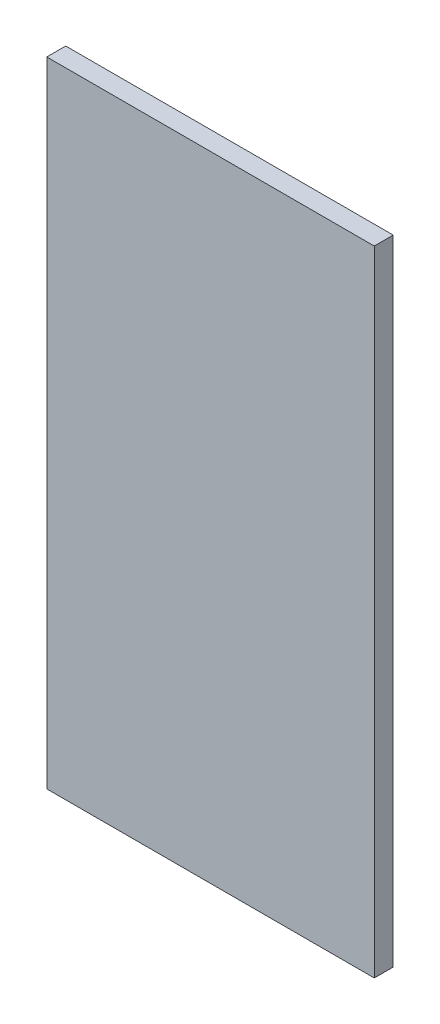
ISO-10303-21;
HEADER;
FILE_DESCRIPTION(('STEP AP214'),'2;1');
FILE_NAME('part.step','',(''),(''),'','','');
FILE_SCHEMA(('AUTOMOTIVE_DESIGN { 1 0 10303 214 1 1 1 1 }'));
ENDSEC;
DATA;
#1=APPLICATION_CONTEXT('core data for automotive mechanical design processes');
#2=APPLICATION_PROTOCOL_DEFINITION('international standard','automotive_design',2000,#1);
#3=PRODUCT_CONTEXT('',#1,'mechanical');
#4=PRODUCT('Part','Part','',(#3));
#5=PRODUCT_RELATED_PRODUCT_CATEGORY('part','',(#4));
#6=PRODUCT_DEFINITION_FORMATION('','',#4);
#7=PRODUCT_DEFINITION_CONTEXT('part definition',#1,'design');
#8=PRODUCT_DEFINITION('design','',#6,#7);
#9=PRODUCT_DEFINITION_SHAPE('','',#8);
#10=(LENGTH_UNIT() NAMED_UNIT(*) SI_UNIT(.MILLI.,.METRE.));
#11=(NAMED_UNIT(*) PLANE_ANGLE_UNIT() SI_UNIT($,.RADIAN.));
#12=(NAMED_UNIT(*) SI_UNIT($,.STERADIAN.) SOLID_ANGLE_UNIT());
#13=UNCERTAINTY_MEASURE_WITH_UNIT(LENGTH_MEASURE(1.E-05),#10,'distance_accuracy_value','');
#14=(GEOMETRIC_REPRESENTATION_CONTEXT(3) GLOBAL_UNCERTAINTY_ASSIGNED_CONTEXT((#13)) GLOBAL_UNIT_ASSIGNED_CONTEXT((#10,
#11,#12)) REPRESENTATION_CONTEXT('',''));
#15=CARTESIAN_POINT('',(0.,0.,0.));
#16=DIRECTION('',(0.,0.,1.));
#17=DIRECTION('',(1.,0.,0.));
#18=AXIS2_PLACEMENT_3D('',#15,#16,#17);
#19=CARTESIAN_POINT('',(-155.5,-301.,18.));
#20=DIRECTION('',(1.,0.,0.));
#21=DIRECTION('',(0.,0.,-1.));
#22=AXIS2_PLACEMENT_3D('',#19,#20,#21);
#23=PLANE('',#22);
#24=DIRECTION('',(0.,-1.,0.));
#25=VECTOR('',#24,1.);
#26=CARTESIAN_POINT('',(-155.5,-301.,0.));
#27=LINE('',#26,#25);
#28=CARTESIAN_POINT('',(-155.5,301.,0.));
#29=VERTEX_POINT('',#28);
#30=CARTESIAN_POINT('',(-155.5,-301.,0.));
#31=VERTEX_POINT('',#30);
#32=EDGE_CURVE('E95',#29,#31,#27,.T.);
#33=ORIENTED_EDGE('',*,*,#32,.T.);
#34=DIRECTION('',(0.,0.,-1.));
#35=VECTOR('',#34,1.);
#36=CARTESIAN_POINT('',(-155.5,-301.,18.));
#37=LINE('',#36,#35);
#38=CARTESIAN_POINT('',(-155.5,-301.,18.));
#39=VERTEX_POINT('',#38);
#40=EDGE_CURVE('E11',#39,#31,#37,.T.);
#41=ORIENTED_EDGE('',*,*,#40,.F.);
#42=DIRECTION('',(0.,-1.,0.));
#43=VECTOR('',#42,1.);
#44=CARTESIAN_POINT('',(-155.5,-301.,18.));
#45=LINE('',#44,#43);
#46=CARTESIAN_POINT('',(-155.5,301.,18.));
#47=VERTEX_POINT('',#46);
#48=EDGE_CURVE('E83',#47,#39,#45,.T.);
#49=ORIENTED_EDGE('',*,*,#48,.F.);
#50=DIRECTION('',(0.,0.,-1.));
#51=VECTOR('',#50,1.);
#52=CARTESIAN_POINT('',(-155.5,301.,18.));
#53=LINE('',#52,#51);
#54=EDGE_CURVE('E91',#47,#29,#53,.T.);
#55=ORIENTED_EDGE('',*,*,#54,.T.);
#56=EDGE_LOOP('',(#33,#41,#49,#55));
#57=FACE_BOUND('',#56,.T.);
#58=ADVANCED_FACE('F32',(#57),#23,.F.);
#59=CARTESIAN_POINT('',(155.5,-301.,18.));
#60=DIRECTION('',(0.,1.,0.));
#61=DIRECTION('',(0.,0.,1.));
#62=AXIS2_PLACEMENT_3D('',#59,#60,#61);
#63=PLANE('',#62);
#64=DIRECTION('',(1.,0.,0.));
#65=VECTOR('',#64,1.);
#66=CARTESIAN_POINT('',(155.5,-301.,0.));
#67=LINE('',#66,#65);
#68=CARTESIAN_POINT('',(155.5,-301.,0.));
#69=VERTEX_POINT('',#68);
#70=EDGE_CURVE('E87',#31,#69,#67,.T.);
#71=ORIENTED_EDGE('',*,*,#70,.T.);
#72=DIRECTION('',(0.,0.,-1.));
#73=VECTOR('',#72,1.);
#74=CARTESIAN_POINT('',(155.5,-301.,18.));
#75=LINE('',#74,#73);
#76=CARTESIAN_POINT('',(155.5,-301.,18.));
#77=VERTEX_POINT('',#76);
#78=EDGE_CURVE('E40',#77,#69,#75,.T.);
#79=ORIENTED_EDGE('',*,*,#78,.F.);
#80=DIRECTION('',(1.,0.,0.));
#81=VECTOR('',#80,1.);
#82=CARTESIAN_POINT('',(155.5,-301.,18.));
#83=LINE('',#82,#81);
#84=EDGE_CURVE('E78',#39,#77,#83,.T.);
#85=ORIENTED_EDGE('',*,*,#84,.F.);
#86=ORIENTED_EDGE('',*,*,#40,.T.);
#87=EDGE_LOOP('',(#71,#79,#85,#86));
#88=FACE_BOUND('',#87,.T.);
#89=ADVANCED_FACE('F86',(#88),#63,.F.);
#90=CARTESIAN_POINT('',(155.5,-301.,18.));
#91=DIRECTION('',(-1.,0.,0.));
#92=DIRECTION('',(0.,0.,1.));
#93=AXIS2_PLACEMENT_3D('',#90,#91,#92);
#94=PLANE('',#93);
#95=DIRECTION('',(0.,1.,0.));
#96=VECTOR('',#95,1.);
#97=CARTESIAN_POINT('',(155.5,-301.,0.));
#98=LINE('',#97,#96);
#99=CARTESIAN_POINT('',(155.5,301.,0.));
#100=VERTEX_POINT('',#99);
#101=EDGE_CURVE('E65',#69,#100,#98,.T.);
#102=ORIENTED_EDGE('',*,*,#101,.T.);
#103=DIRECTION('',(0.,0.,-1.));
#104=VECTOR('',#103,1.);
#105=CARTESIAN_POINT('',(155.5,301.,18.));
#106=LINE('',#105,#104);
#107=CARTESIAN_POINT('',(155.5,301.,18.));
#108=VERTEX_POINT('',#107);
#109=EDGE_CURVE('E88',#108,#100,#106,.T.);
#110=ORIENTED_EDGE('',*,*,#109,.F.);
#111=DIRECTION('',(0.,1.,0.));
#112=VECTOR('',#111,1.);
#113=CARTESIAN_POINT('',(155.5,-301.,18.));
#114=LINE('',#113,#112);
#115=EDGE_CURVE('E81',#77,#108,#114,.T.);
#116=ORIENTED_EDGE('',*,*,#115,.F.);
#117=ORIENTED_EDGE('',*,*,#78,.T.);
#118=EDGE_LOOP('',(#102,#110,#116,#117));
#119=FACE_BOUND('',#118,.T.);
#120=ADVANCED_FACE('F89',(#119),#94,.F.);
#121=CARTESIAN_POINT('',(155.5,301.,18.));
#122=DIRECTION('',(0.,-1.,0.));
#123=DIRECTION('',(0.,0.,-1.));
#124=AXIS2_PLACEMENT_3D('',#121,#122,#123);
#125=PLANE('',#124);
#126=DIRECTION('',(-1.,0.,0.));
#127=VECTOR('',#126,1.);
#128=CARTESIAN_POINT('',(155.5,301.,0.));
#129=LINE('',#128,#127);
#130=EDGE_CURVE('E71',#100,#29,#129,.T.);
#131=ORIENTED_EDGE('',*,*,#130,.T.);
#132=ORIENTED_EDGE('',*,*,#54,.F.);
#133=DIRECTION('',(-1.,0.,0.));
#134=VECTOR('',#133,1.);
#135=CARTESIAN_POINT('',(155.5,301.,18.));
#136=LINE('',#135,#134);
#137=EDGE_CURVE('E48',#108,#47,#136,.T.);
#138=ORIENTED_EDGE('',*,*,#137,.F.);
#139=ORIENTED_EDGE('',*,*,#109,.T.);
#140=EDGE_LOOP('',(#131,#132,#138,#139));
#141=FACE_BOUND('',#140,.T.);
#142=ADVANCED_FACE('F102',(#141),#125,.F.);
#143=CARTESIAN_POINT('',(0.,0.,18.));
#144=DIRECTION('',(0.,0.,1.));
#145=DIRECTION('',(1.,0.,0.));
#146=AXIS2_PLACEMENT_3D('',#143,#144,#145);
#147=PLANE('',#146);
#148=ORIENTED_EDGE('',*,*,#48,.T.);
#149=ORIENTED_EDGE('',*,*,#84,.T.);
#150=ORIENTED_EDGE('',*,*,#115,.T.);
#151=ORIENTED_EDGE('',*,*,#137,.T.);
#152=EDGE_LOOP('',(#148,#149,#150,#151));
#153=FACE_BOUND('',#152,.T.);
#154=ADVANCED_FACE('F79',(#153),#147,.T.);
#155=CARTESIAN_POINT('',(0.,0.,0.));
#156=DIRECTION('',(0.,0.,1.));
#157=DIRECTION('',(1.,0.,0.));
#158=AXIS2_PLACEMENT_3D('',#155,#156,#157);
#159=PLANE('',#158);
#160=ORIENTED_EDGE('',*,*,#32,.F.);
#161=ORIENTED_EDGE('',*,*,#130,.F.);
#162=ORIENTED_EDGE('',*,*,#101,.F.);
#163=ORIENTED_EDGE('',*,*,#70,.F.);
#164=EDGE_LOOP('',(#160,#161,#162,#163));
#165=FACE_BOUND('',#164,.T.);
#166=ADVANCED_FACE('F105',(#165),#159,.F.);
#167=CLOSED_SHELL('',(#58,#89,#120,#142,#154,#166));
#168=MANIFOLD_SOLID_BREP('B2',#167);
#169=ADVANCED_BREP_SHAPE_REPRESENTATION('',(#18,#168),#14);
#170=SHAPE_DEFINITION_REPRESENTATION(#9,#169);
ENDSEC;
END-ISO-10303-21;
